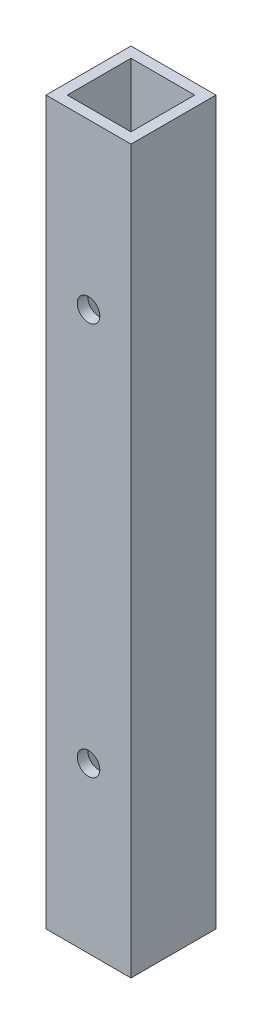
ISO-10303-21;
HEADER;
FILE_DESCRIPTION(('STEP AP214'),'2;1');
FILE_NAME('part.step','',(''),(''),'','','');
FILE_SCHEMA(('AUTOMOTIVE_DESIGN { 1 0 10303 214 1 1 1 1 }'));
ENDSEC;
DATA;
#1=APPLICATION_CONTEXT('core data for automotive mechanical design processes');
#2=APPLICATION_PROTOCOL_DEFINITION('international standard','automotive_design',2000,#1);
#3=PRODUCT_CONTEXT('',#1,'mechanical');
#4=PRODUCT('Part','Part','',(#3));
#5=PRODUCT_RELATED_PRODUCT_CATEGORY('part','',(#4));
#6=PRODUCT_DEFINITION_FORMATION('','',#4);
#7=PRODUCT_DEFINITION_CONTEXT('part definition',#1,'design');
#8=PRODUCT_DEFINITION('design','',#6,#7);
#9=PRODUCT_DEFINITION_SHAPE('','',#8);
#10=(LENGTH_UNIT() NAMED_UNIT(*) SI_UNIT(.MILLI.,.METRE.));
#11=(NAMED_UNIT(*) PLANE_ANGLE_UNIT() SI_UNIT($,.RADIAN.));
#12=(NAMED_UNIT(*) SI_UNIT($,.STERADIAN.) SOLID_ANGLE_UNIT());
#13=UNCERTAINTY_MEASURE_WITH_UNIT(LENGTH_MEASURE(1.E-05),#10,'distance_accuracy_value','');
#14=(GEOMETRIC_REPRESENTATION_CONTEXT(3) GLOBAL_UNCERTAINTY_ASSIGNED_CONTEXT((#13)) GLOBAL_UNIT_ASSIGNED_CONTEXT((#10,
#11,#12)) REPRESENTATION_CONTEXT('',''));
#15=CARTESIAN_POINT('',(0.,0.,0.));
#16=DIRECTION('',(0.,0.,1.));
#17=DIRECTION('',(1.,0.,0.));
#18=AXIS2_PLACEMENT_3D('',#15,#16,#17);
#19=CARTESIAN_POINT('',(-190.5,266.7,609.6));
#20=DIRECTION('',(0.,-1.,0.));
#21=DIRECTION('',(0.,0.,-1.));
#22=AXIS2_PLACEMENT_3D('',#19,#20,#21);
#23=PLANE('',#22);
#24=DIRECTION('',(-1.,0.,0.));
#25=VECTOR('',#24,1.);
#26=CARTESIAN_POINT('',(-190.5,266.7,558.8));
#27=LINE('',#26,#25);
#28=CARTESIAN_POINT('',(-165.1,266.7,558.8));
#29=VERTEX_POINT('',#28);
#30=CARTESIAN_POINT('',(-215.9,266.7,558.8));
#31=VERTEX_POINT('',#30);
#32=EDGE_CURVE('E157',#29,#31,#27,.T.);
#33=ORIENTED_EDGE('',*,*,#32,.T.);
#34=DIRECTION('',(0.,0.,-1.));
#35=VECTOR('',#34,1.);
#36=CARTESIAN_POINT('',(-215.9,266.7,609.6));
#37=LINE('',#36,#35);
#38=CARTESIAN_POINT('',(-215.9,266.7,609.6));
#39=VERTEX_POINT('',#38);
#40=EDGE_CURVE('E166',#39,#31,#37,.T.);
#41=ORIENTED_EDGE('',*,*,#40,.F.);
#42=DIRECTION('',(-1.,0.,0.));
#43=VECTOR('',#42,1.);
#44=CARTESIAN_POINT('',(-190.5,266.7,609.6));
#45=LINE('',#44,#43);
#46=CARTESIAN_POINT('',(-165.1,266.7,609.6));
#47=VERTEX_POINT('',#46);
#48=EDGE_CURVE('E163',#47,#39,#45,.T.);
#49=ORIENTED_EDGE('',*,*,#48,.F.);
#50=DIRECTION('',(0.,0.,-1.));
#51=VECTOR('',#50,1.);
#52=CARTESIAN_POINT('',(-165.1,266.7,609.6));
#53=LINE('',#52,#51);
#54=EDGE_CURVE('E181',#47,#29,#53,.T.);
#55=ORIENTED_EDGE('',*,*,#54,.T.);
#56=EDGE_LOOP('',(#33,#41,#49,#55));
#57=FACE_BOUND('',#56,.T.);
#58=DIRECTION('',(-1.,0.,0.));
#59=VECTOR('',#58,1.);
#60=CARTESIAN_POINT('',(-190.5,266.7,565.15));
#61=LINE('',#60,#59);
#62=CARTESIAN_POINT('',(-171.45,266.7,565.15));
#63=VERTEX_POINT('',#62);
#64=CARTESIAN_POINT('',(-209.55,266.7,565.15));
#65=VERTEX_POINT('',#64);
#66=EDGE_CURVE('E122',#63,#65,#61,.T.);
#67=ORIENTED_EDGE('',*,*,#66,.F.);
#68=DIRECTION('',(0.,0.,-1.));
#69=VECTOR('',#68,1.);
#70=CARTESIAN_POINT('',(-171.45,266.7,609.6));
#71=LINE('',#70,#69);
#72=CARTESIAN_POINT('',(-171.45,266.7,603.25));
#73=VERTEX_POINT('',#72);
#74=EDGE_CURVE('E139',#73,#63,#71,.T.);
#75=ORIENTED_EDGE('',*,*,#74,.F.);
#76=DIRECTION('',(-1.,0.,0.));
#77=VECTOR('',#76,1.);
#78=CARTESIAN_POINT('',(-190.5,266.7,603.25));
#79=LINE('',#78,#77);
#80=CARTESIAN_POINT('',(-209.55,266.7,603.25));
#81=VERTEX_POINT('',#80);
#82=EDGE_CURVE('E39',#73,#81,#79,.T.);
#83=ORIENTED_EDGE('',*,*,#82,.T.);
#84=DIRECTION('',(0.,0.,-1.));
#85=VECTOR('',#84,1.);
#86=CARTESIAN_POINT('',(-209.55,266.7,609.6));
#87=LINE('',#86,#85);
#88=EDGE_CURVE('E143',#81,#65,#87,.T.);
#89=ORIENTED_EDGE('',*,*,#88,.T.);
#90=EDGE_LOOP('',(#67,#75,#83,#89));
#91=FACE_BOUND('',#90,.T.);
#92=ADVANCED_FACE('F16',(#57,#91),#23,.F.);
#93=CARTESIAN_POINT('',(-190.5,-165.1,609.6));
#94=DIRECTION('',(0.,1.,0.));
#95=DIRECTION('',(0.,0.,1.));
#96=AXIS2_PLACEMENT_3D('',#93,#94,#95);
#97=PLANE('',#96);
#98=DIRECTION('',(1.,0.,0.));
#99=VECTOR('',#98,1.);
#100=CARTESIAN_POINT('',(-190.5,-165.1,558.8));
#101=LINE('',#100,#99);
#102=CARTESIAN_POINT('',(-215.9,-165.1,558.8));
#103=VERTEX_POINT('',#102);
#104=CARTESIAN_POINT('',(-165.1,-165.1,558.8));
#105=VERTEX_POINT('',#104);
#106=EDGE_CURVE('E170',#103,#105,#101,.T.);
#107=ORIENTED_EDGE('',*,*,#106,.T.);
#108=DIRECTION('',(0.,0.,-1.));
#109=VECTOR('',#108,1.);
#110=CARTESIAN_POINT('',(-165.1,-165.1,609.6));
#111=LINE('',#110,#109);
#112=CARTESIAN_POINT('',(-165.1,-165.1,609.6));
#113=VERTEX_POINT('',#112);
#114=EDGE_CURVE('E26',#113,#105,#111,.T.);
#115=ORIENTED_EDGE('',*,*,#114,.F.);
#116=DIRECTION('',(1.,0.,0.));
#117=VECTOR('',#116,1.);
#118=CARTESIAN_POINT('',(-190.5,-165.1,609.6));
#119=LINE('',#118,#117);
#120=CARTESIAN_POINT('',(-215.9,-165.1,609.6));
#121=VERTEX_POINT('',#120);
#122=EDGE_CURVE('E156',#121,#113,#119,.T.);
#123=ORIENTED_EDGE('',*,*,#122,.F.);
#124=DIRECTION('',(0.,0.,-1.));
#125=VECTOR('',#124,1.);
#126=CARTESIAN_POINT('',(-215.9,-165.1,609.6));
#127=LINE('',#126,#125);
#128=EDGE_CURVE('E11',#121,#103,#127,.T.);
#129=ORIENTED_EDGE('',*,*,#128,.T.);
#130=EDGE_LOOP('',(#107,#115,#123,#129));
#131=FACE_BOUND('',#130,.T.);
#132=DIRECTION('',(1.,0.,0.));
#133=VECTOR('',#132,1.);
#134=CARTESIAN_POINT('',(-190.5,-165.1,565.15));
#135=LINE('',#134,#133);
#136=CARTESIAN_POINT('',(-209.55,-165.1,565.15));
#137=VERTEX_POINT('',#136);
#138=CARTESIAN_POINT('',(-171.45,-165.1,565.15));
#139=VERTEX_POINT('',#138);
#140=EDGE_CURVE('E119',#137,#139,#135,.T.);
#141=ORIENTED_EDGE('',*,*,#140,.F.);
#142=DIRECTION('',(0.,0.,-1.));
#143=VECTOR('',#142,1.);
#144=CARTESIAN_POINT('',(-209.55,-165.1,609.6));
#145=LINE('',#144,#143);
#146=CARTESIAN_POINT('',(-209.55,-165.1,603.25));
#147=VERTEX_POINT('',#146);
#148=EDGE_CURVE('E105',#147,#137,#145,.T.);
#149=ORIENTED_EDGE('',*,*,#148,.F.);
#150=DIRECTION('',(1.,0.,0.));
#151=VECTOR('',#150,1.);
#152=CARTESIAN_POINT('',(-190.5,-165.1,603.25));
#153=LINE('',#152,#151);
#154=CARTESIAN_POINT('',(-171.45,-165.1,603.25));
#155=VERTEX_POINT('',#154);
#156=EDGE_CURVE('E140',#147,#155,#153,.T.);
#157=ORIENTED_EDGE('',*,*,#156,.T.);
#158=DIRECTION('',(0.,0.,-1.));
#159=VECTOR('',#158,1.);
#160=CARTESIAN_POINT('',(-171.45,-165.1,609.6));
#161=LINE('',#160,#159);
#162=EDGE_CURVE('E115',#155,#139,#161,.T.);
#163=ORIENTED_EDGE('',*,*,#162,.T.);
#164=EDGE_LOOP('',(#141,#149,#157,#163));
#165=FACE_BOUND('',#164,.T.);
#166=ADVANCED_FACE('F127',(#131,#165),#97,.F.);
#167=CARTESIAN_POINT('',(-215.9,50.8,609.6));
#168=DIRECTION('',(1.,0.,0.));
#169=DIRECTION('',(0.,0.,-1.));
#170=AXIS2_PLACEMENT_3D('',#167,#168,#169);
#171=PLANE('',#170);
#172=DIRECTION('',(0.,-1.,0.));
#173=VECTOR('',#172,1.);
#174=CARTESIAN_POINT('',(-215.9,50.8,558.8));
#175=LINE('',#174,#173);
#176=EDGE_CURVE('E114',#31,#103,#175,.T.);
#177=ORIENTED_EDGE('',*,*,#176,.T.);
#178=ORIENTED_EDGE('',*,*,#128,.F.);
#179=DIRECTION('',(0.,-1.,0.));
#180=VECTOR('',#179,1.);
#181=CARTESIAN_POINT('',(-215.9,50.8,609.6));
#182=LINE('',#181,#180);
#183=EDGE_CURVE('E152',#39,#121,#182,.T.);
#184=ORIENTED_EDGE('',*,*,#183,.F.);
#185=ORIENTED_EDGE('',*,*,#40,.T.);
#186=EDGE_LOOP('',(#177,#178,#184,#185));
#187=FACE_BOUND('',#186,.T.);
#188=ADVANCED_FACE('F18',(#187),#171,.F.);
#189=CARTESIAN_POINT('',(-165.1,50.8,609.6));
#190=DIRECTION('',(-1.,0.,0.));
#191=DIRECTION('',(0.,0.,1.));
#192=AXIS2_PLACEMENT_3D('',#189,#190,#191);
#193=PLANE('',#192);
#194=DIRECTION('',(0.,1.,0.));
#195=VECTOR('',#194,1.);
#196=CARTESIAN_POINT('',(-165.1,50.8,558.8));
#197=LINE('',#196,#195);
#198=EDGE_CURVE('E173',#105,#29,#197,.T.);
#199=ORIENTED_EDGE('',*,*,#198,.T.);
#200=ORIENTED_EDGE('',*,*,#54,.F.);
#201=DIRECTION('',(0.,1.,0.));
#202=VECTOR('',#201,1.);
#203=CARTESIAN_POINT('',(-165.1,50.8,609.6));
#204=LINE('',#203,#202);
#205=EDGE_CURVE('E160',#113,#47,#204,.T.);
#206=ORIENTED_EDGE('',*,*,#205,.F.);
#207=ORIENTED_EDGE('',*,*,#114,.T.);
#208=EDGE_LOOP('',(#199,#200,#206,#207));
#209=FACE_BOUND('',#208,.T.);
#210=ADVANCED_FACE('F249',(#209),#193,.F.);
#211=CARTESIAN_POINT('',(-190.5,50.8,609.6));
#212=DIRECTION('',(0.,0.,1.));
#213=DIRECTION('',(1.,0.,0.));
#214=AXIS2_PLACEMENT_3D('',#211,#212,#213);
#215=PLANE('',#214);
#216=CARTESIAN_POINT('',(-190.5,-66.675,609.6));
#217=DIRECTION('',(0.,0.,1.));
#218=DIRECTION('',(1.,0.,0.));
#219=AXIS2_PLACEMENT_3D('',#216,#217,#218);
#220=CIRCLE('',#219,6.74624);
#221=CARTESIAN_POINT('',(-183.75376,-66.675,609.6));
#222=VERTEX_POINT('',#221);
#223=EDGE_CURVE('E201',#222,#222,#220,.F.);
#224=ORIENTED_EDGE('',*,*,#223,.T.);
#225=EDGE_LOOP('',(#224));
#226=FACE_BOUND('',#225,.T.);
#227=CARTESIAN_POINT('',(-190.5,168.275,609.6));
#228=DIRECTION('',(0.,0.,1.));
#229=DIRECTION('',(1.,0.,0.));
#230=AXIS2_PLACEMENT_3D('',#227,#228,#229);
#231=CIRCLE('',#230,6.74624);
#232=CARTESIAN_POINT('',(-183.75376,168.275,609.6));
#233=VERTEX_POINT('',#232);
#234=EDGE_CURVE('E124',#233,#233,#231,.F.);
#235=ORIENTED_EDGE('',*,*,#234,.T.);
#236=EDGE_LOOP('',(#235));
#237=FACE_BOUND('',#236,.T.);
#238=ORIENTED_EDGE('',*,*,#183,.T.);
#239=ORIENTED_EDGE('',*,*,#122,.T.);
#240=ORIENTED_EDGE('',*,*,#205,.T.);
#241=ORIENTED_EDGE('',*,*,#48,.T.);
#242=EDGE_LOOP('',(#238,#239,#240,#241));
#243=FACE_BOUND('',#242,.T.);
#244=ADVANCED_FACE('F251',(#226,#237,#243),#215,.T.);
#245=CARTESIAN_POINT('',(-190.5,50.8,558.8));
#246=DIRECTION('',(0.,0.,1.));
#247=DIRECTION('',(1.,0.,0.));
#248=AXIS2_PLACEMENT_3D('',#245,#246,#247);
#249=PLANE('',#248);
#250=CARTESIAN_POINT('',(-190.5,-66.675,558.8));
#251=DIRECTION('',(0.,0.,-1.));
#252=DIRECTION('',(-1.,0.,0.));
#253=AXIS2_PLACEMENT_3D('',#250,#251,#252);
#254=CIRCLE('',#253,6.74624);
#255=CARTESIAN_POINT('',(-197.24624,-66.675,558.8));
#256=VERTEX_POINT('',#255);
#257=EDGE_CURVE('E280',#256,#256,#254,.T.);
#258=ORIENTED_EDGE('',*,*,#257,.F.);
#259=EDGE_LOOP('',(#258));
#260=FACE_BOUND('',#259,.T.);
#261=CARTESIAN_POINT('',(-190.5,168.275,558.8));
#262=DIRECTION('',(0.,0.,-1.));
#263=DIRECTION('',(-1.,0.,0.));
#264=AXIS2_PLACEMENT_3D('',#261,#262,#263);
#265=CIRCLE('',#264,6.74624);
#266=CARTESIAN_POINT('',(-197.24624,168.275,558.8));
#267=VERTEX_POINT('',#266);
#268=EDGE_CURVE('E191',#267,#267,#265,.T.);
#269=ORIENTED_EDGE('',*,*,#268,.F.);
#270=EDGE_LOOP('',(#269));
#271=FACE_BOUND('',#270,.T.);
#272=ORIENTED_EDGE('',*,*,#176,.F.);
#273=ORIENTED_EDGE('',*,*,#32,.F.);
#274=ORIENTED_EDGE('',*,*,#198,.F.);
#275=ORIENTED_EDGE('',*,*,#106,.F.);
#276=EDGE_LOOP('',(#272,#273,#274,#275));
#277=FACE_BOUND('',#276,.T.);
#278=ADVANCED_FACE('F247',(#260,#271,#277),#249,.F.);
#279=CARTESIAN_POINT('',(-209.55,50.8,609.6));
#280=DIRECTION('',(1.,0.,0.));
#281=DIRECTION('',(0.,0.,-1.));
#282=AXIS2_PLACEMENT_3D('',#279,#280,#281);
#283=PLANE('',#282);
#284=DIRECTION('',(0.,-1.,0.));
#285=VECTOR('',#284,1.);
#286=CARTESIAN_POINT('',(-209.55,50.8,565.15));
#287=LINE('',#286,#285);
#288=EDGE_CURVE('E108',#65,#137,#287,.T.);
#289=ORIENTED_EDGE('',*,*,#288,.F.);
#290=ORIENTED_EDGE('',*,*,#88,.F.);
#291=DIRECTION('',(0.,-1.,0.));
#292=VECTOR('',#291,1.);
#293=CARTESIAN_POINT('',(-209.55,50.8,603.25));
#294=LINE('',#293,#292);
#295=EDGE_CURVE('E50',#81,#147,#294,.T.);
#296=ORIENTED_EDGE('',*,*,#295,.T.);
#297=ORIENTED_EDGE('',*,*,#148,.T.);
#298=EDGE_LOOP('',(#289,#290,#296,#297));
#299=FACE_BOUND('',#298,.T.);
#300=ADVANCED_FACE('F107',(#299),#283,.T.);
#301=CARTESIAN_POINT('',(-171.45,50.8,609.6));
#302=DIRECTION('',(-1.,0.,0.));
#303=DIRECTION('',(0.,0.,1.));
#304=AXIS2_PLACEMENT_3D('',#301,#302,#303);
#305=PLANE('',#304);
#306=DIRECTION('',(0.,1.,0.));
#307=VECTOR('',#306,1.);
#308=CARTESIAN_POINT('',(-171.45,50.8,565.15));
#309=LINE('',#308,#307);
#310=EDGE_CURVE('E129',#139,#63,#309,.T.);
#311=ORIENTED_EDGE('',*,*,#310,.F.);
#312=ORIENTED_EDGE('',*,*,#162,.F.);
#313=DIRECTION('',(0.,1.,0.));
#314=VECTOR('',#313,1.);
#315=CARTESIAN_POINT('',(-171.45,50.8,603.25));
#316=LINE('',#315,#314);
#317=EDGE_CURVE('E142',#155,#73,#316,.T.);
#318=ORIENTED_EDGE('',*,*,#317,.T.);
#319=ORIENTED_EDGE('',*,*,#74,.T.);
#320=EDGE_LOOP('',(#311,#312,#318,#319));
#321=FACE_BOUND('',#320,.T.);
#322=ADVANCED_FACE('F221',(#321),#305,.T.);
#323=CARTESIAN_POINT('',(-190.5,50.8,603.25));
#324=DIRECTION('',(0.,0.,1.));
#325=DIRECTION('',(1.,0.,0.));
#326=AXIS2_PLACEMENT_3D('',#323,#324,#325);
#327=PLANE('',#326);
#328=CARTESIAN_POINT('',(-190.5,-66.675,603.25));
#329=DIRECTION('',(0.,0.,1.));
#330=DIRECTION('',(1.,0.,0.));
#331=AXIS2_PLACEMENT_3D('',#328,#329,#330);
#332=CIRCLE('',#331,6.74624);
#333=CARTESIAN_POINT('',(-183.75376,-66.675,603.25));
#334=VERTEX_POINT('',#333);
#335=EDGE_CURVE('E209',#334,#334,#332,.F.);
#336=ORIENTED_EDGE('',*,*,#335,.F.);
#337=EDGE_LOOP('',(#336));
#338=FACE_BOUND('',#337,.T.);
#339=CARTESIAN_POINT('',(-190.5,168.275,603.25));
#340=DIRECTION('',(0.,0.,1.));
#341=DIRECTION('',(1.,0.,0.));
#342=AXIS2_PLACEMENT_3D('',#339,#340,#341);
#343=CIRCLE('',#342,6.74624);
#344=CARTESIAN_POINT('',(-183.75376,168.275,603.25));
#345=VERTEX_POINT('',#344);
#346=EDGE_CURVE('E190',#345,#345,#343,.F.);
#347=ORIENTED_EDGE('',*,*,#346,.F.);
#348=EDGE_LOOP('',(#347));
#349=FACE_BOUND('',#348,.T.);
#350=ORIENTED_EDGE('',*,*,#295,.F.);
#351=ORIENTED_EDGE('',*,*,#82,.F.);
#352=ORIENTED_EDGE('',*,*,#317,.F.);
#353=ORIENTED_EDGE('',*,*,#156,.F.);
#354=EDGE_LOOP('',(#350,#351,#352,#353));
#355=FACE_BOUND('',#354,.T.);
#356=ADVANCED_FACE('F223',(#338,#349,#355),#327,.F.);
#357=CARTESIAN_POINT('',(-190.5,50.8,565.15));
#358=DIRECTION('',(0.,0.,1.));
#359=DIRECTION('',(1.,0.,0.));
#360=AXIS2_PLACEMENT_3D('',#357,#358,#359);
#361=PLANE('',#360);
#362=CARTESIAN_POINT('',(-190.5,-66.675,565.15));
#363=DIRECTION('',(0.,0.,1.));
#364=DIRECTION('',(1.,0.,0.));
#365=AXIS2_PLACEMENT_3D('',#362,#363,#364);
#366=CIRCLE('',#365,6.74624);
#367=CARTESIAN_POINT('',(-183.75376,-66.675,565.15));
#368=VERTEX_POINT('',#367);
#369=EDGE_CURVE('E20',#368,#368,#366,.F.);
#370=ORIENTED_EDGE('',*,*,#369,.T.);
#371=EDGE_LOOP('',(#370));
#372=FACE_BOUND('',#371,.T.);
#373=CARTESIAN_POINT('',(-190.5,168.275,565.15));
#374=DIRECTION('',(0.,0.,1.));
#375=DIRECTION('',(1.,0.,0.));
#376=AXIS2_PLACEMENT_3D('',#373,#374,#375);
#377=CIRCLE('',#376,6.74624);
#378=CARTESIAN_POINT('',(-183.75376,168.275,565.15));
#379=VERTEX_POINT('',#378);
#380=EDGE_CURVE('E187',#379,#379,#377,.F.);
#381=ORIENTED_EDGE('',*,*,#380,.T.);
#382=EDGE_LOOP('',(#381));
#383=FACE_BOUND('',#382,.T.);
#384=ORIENTED_EDGE('',*,*,#288,.T.);
#385=ORIENTED_EDGE('',*,*,#140,.T.);
#386=ORIENTED_EDGE('',*,*,#310,.T.);
#387=ORIENTED_EDGE('',*,*,#66,.T.);
#388=EDGE_LOOP('',(#384,#385,#386,#387));
#389=FACE_BOUND('',#388,.T.);
#390=ADVANCED_FACE('F118',(#372,#383,#389),#361,.T.);
#391=CARTESIAN_POINT('',(-190.5,168.275,998.562448637452));
#392=DIRECTION('',(0.,0.,-1.));
#393=DIRECTION('',(-1.,0.,0.));
#394=AXIS2_PLACEMENT_3D('',#391,#392,#393);
#395=CYLINDRICAL_SURFACE('',#394,6.74624);
#396=ORIENTED_EDGE('',*,*,#380,.F.);
#397=EDGE_LOOP('',(#396));
#398=FACE_BOUND('',#397,.T.);
#399=ORIENTED_EDGE('',*,*,#268,.T.);
#400=EDGE_LOOP('',(#399));
#401=FACE_BOUND('',#400,.T.);
#402=ADVANCED_FACE('F232',(#398,#401),#395,.F.);
#403=ORIENTED_EDGE('',*,*,#234,.F.);
#404=EDGE_LOOP('',(#403));
#405=FACE_BOUND('',#404,.T.);
#406=ORIENTED_EDGE('',*,*,#346,.T.);
#407=EDGE_LOOP('',(#406));
#408=FACE_BOUND('',#407,.T.);
#409=ADVANCED_FACE('F302',(#405,#408),#395,.F.);
#410=CARTESIAN_POINT('',(-190.5,-66.675,998.562448637452));
#411=DIRECTION('',(0.,0.,-1.));
#412=DIRECTION('',(-1.,0.,0.));
#413=AXIS2_PLACEMENT_3D('',#410,#411,#412);
#414=CYLINDRICAL_SURFACE('',#413,6.74624);
#415=ORIENTED_EDGE('',*,*,#369,.F.);
#416=EDGE_LOOP('',(#415));
#417=FACE_BOUND('',#416,.T.);
#418=ORIENTED_EDGE('',*,*,#257,.T.);
#419=EDGE_LOOP('',(#418));
#420=FACE_BOUND('',#419,.T.);
#421=ADVANCED_FACE('F296',(#417,#420),#414,.F.);
#422=ORIENTED_EDGE('',*,*,#223,.F.);
#423=EDGE_LOOP('',(#422));
#424=FACE_BOUND('',#423,.T.);
#425=ORIENTED_EDGE('',*,*,#335,.T.);
#426=EDGE_LOOP('',(#425));
#427=FACE_BOUND('',#426,.T.);
#428=ADVANCED_FACE('F294',(#424,#427),#414,.F.);
#429=CLOSED_SHELL('',(#92,#166,#188,#210,#244,#278,#300,#322,#356,#390,#402,#409,#421,#428));
#430=MANIFOLD_SOLID_BREP('B1',#429);
#431=ADVANCED_BREP_SHAPE_REPRESENTATION('',(#18,#430),#14);
#432=SHAPE_DEFINITION_REPRESENTATION(#9,#431);
ENDSEC;
END-ISO-10303-21;
